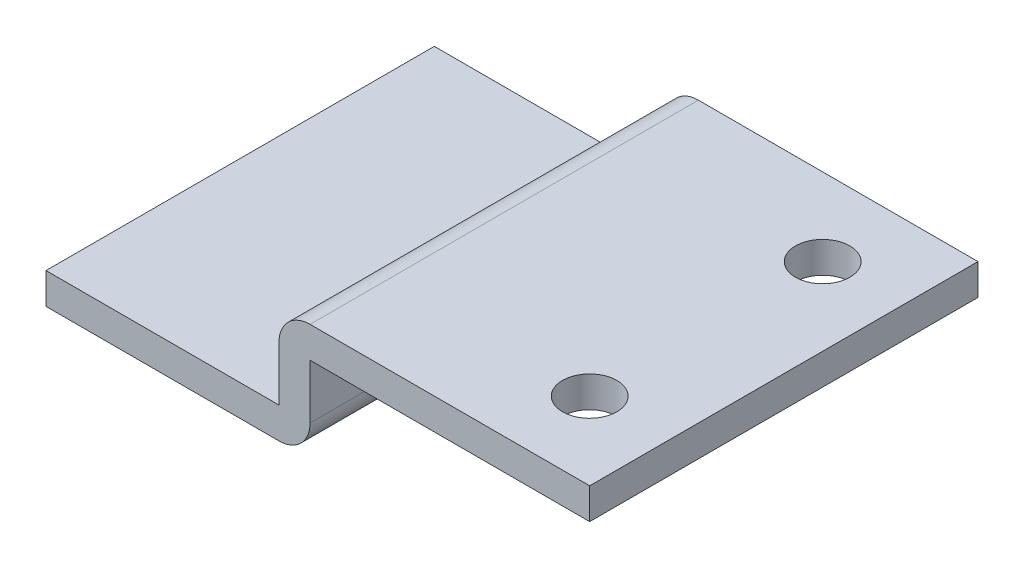
ISO-10303-21;
HEADER;
FILE_DESCRIPTION(('STEP AP214'),'2;1');
FILE_NAME('part.step','',(''),(''),'','','');
FILE_SCHEMA(('AUTOMOTIVE_DESIGN { 1 0 10303 214 1 1 1 1 }'));
ENDSEC;
DATA;
#1=APPLICATION_CONTEXT('core data for automotive mechanical design processes');
#2=APPLICATION_PROTOCOL_DEFINITION('international standard','automotive_design',2000,#1);
#3=PRODUCT_CONTEXT('',#1,'mechanical');
#4=PRODUCT('Part','Part','',(#3));
#5=PRODUCT_RELATED_PRODUCT_CATEGORY('part','',(#4));
#6=PRODUCT_DEFINITION_FORMATION('','',#4);
#7=PRODUCT_DEFINITION_CONTEXT('part definition',#1,'design');
#8=PRODUCT_DEFINITION('design','',#6,#7);
#9=PRODUCT_DEFINITION_SHAPE('','',#8);
#10=(LENGTH_UNIT() NAMED_UNIT(*) SI_UNIT(.MILLI.,.METRE.));
#11=(NAMED_UNIT(*) PLANE_ANGLE_UNIT() SI_UNIT($,.RADIAN.));
#12=(NAMED_UNIT(*) SI_UNIT($,.STERADIAN.) SOLID_ANGLE_UNIT());
#13=UNCERTAINTY_MEASURE_WITH_UNIT(LENGTH_MEASURE(1.E-05),#10,'distance_accuracy_value','');
#14=(GEOMETRIC_REPRESENTATION_CONTEXT(3) GLOBAL_UNCERTAINTY_ASSIGNED_CONTEXT((#13)) GLOBAL_UNIT_ASSIGNED_CONTEXT((#10,
#11,#12)) REPRESENTATION_CONTEXT('',''));
#15=CARTESIAN_POINT('',(0.,0.,0.));
#16=DIRECTION('',(0.,0.,1.));
#17=DIRECTION('',(1.,0.,0.));
#18=AXIS2_PLACEMENT_3D('',#15,#16,#17);
#19=CARTESIAN_POINT('',(0.,0.,12.5));
#20=DIRECTION('',(-1.,0.,0.));
#21=DIRECTION('',(0.,-1.,0.));
#22=AXIS2_PLACEMENT_3D('',#19,#20,#21);
#23=PLANE('',#22);
#24=DIRECTION('',(0.,1.,0.));
#25=VECTOR('',#24,1.);
#26=CARTESIAN_POINT('',(0.,0.,-12.5));
#27=LINE('',#26,#25);
#28=CARTESIAN_POINT('',(0.,0.,-12.5));
#29=VERTEX_POINT('',#28);
#30=CARTESIAN_POINT('',(0.,2.,-12.5));
#31=VERTEX_POINT('',#30);
#32=EDGE_CURVE('E128',#29,#31,#27,.T.);
#33=ORIENTED_EDGE('',*,*,#32,.T.);
#34=DIRECTION('',(0.,0.,-1.));
#35=VECTOR('',#34,1.);
#36=CARTESIAN_POINT('',(0.,2.,12.5));
#37=LINE('',#36,#35);
#38=CARTESIAN_POINT('',(0.,2.,12.5));
#39=VERTEX_POINT('',#38);
#40=EDGE_CURVE('E112',#39,#31,#37,.T.);
#41=ORIENTED_EDGE('',*,*,#40,.F.);
#42=DIRECTION('',(0.,1.,0.));
#43=VECTOR('',#42,1.);
#44=CARTESIAN_POINT('',(0.,0.,12.5));
#45=LINE('',#44,#43);
#46=CARTESIAN_POINT('',(0.,0.,12.5));
#47=VERTEX_POINT('',#46);
#48=EDGE_CURVE('E115',#47,#39,#45,.T.);
#49=ORIENTED_EDGE('',*,*,#48,.F.);
#50=DIRECTION('',(0.,0.,-1.));
#51=VECTOR('',#50,1.);
#52=CARTESIAN_POINT('',(0.,0.,12.5));
#53=LINE('',#52,#51);
#54=EDGE_CURVE('E173',#47,#29,#53,.T.);
#55=ORIENTED_EDGE('',*,*,#54,.T.);
#56=EDGE_LOOP('',(#33,#41,#49,#55));
#57=FACE_BOUND('',#56,.T.);
#58=ADVANCED_FACE('F32',(#57),#23,.F.);
#59=CARTESIAN_POINT('',(0.,2.,12.5));
#60=DIRECTION('',(0.,-1.,0.));
#61=DIRECTION('',(1.,0.,0.));
#62=AXIS2_PLACEMENT_3D('',#59,#60,#61);
#63=PLANE('',#62);
#64=CARTESIAN_POINT('',(-5.,2.,-7.5));
#65=DIRECTION('',(0.,1.,0.));
#66=DIRECTION('',(0.,0.,1.));
#67=AXIS2_PLACEMENT_3D('',#64,#65,#66);
#68=CIRCLE('',#67,1.74999999999999);
#69=CARTESIAN_POINT('',(-5.,2.,-5.75000000000001));
#70=VERTEX_POINT('',#69);
#71=EDGE_CURVE('E161',#70,#70,#68,.T.);
#72=ORIENTED_EDGE('',*,*,#71,.F.);
#73=EDGE_LOOP('',(#72));
#74=FACE_BOUND('',#73,.T.);
#75=CARTESIAN_POINT('',(-5.,2.,7.5));
#76=DIRECTION('',(0.,1.,0.));
#77=DIRECTION('',(0.,0.,1.));
#78=AXIS2_PLACEMENT_3D('',#75,#76,#77);
#79=CIRCLE('',#78,1.74999999999999);
#80=CARTESIAN_POINT('',(-5.,2.,9.24999999999999));
#81=VERTEX_POINT('',#80);
#82=EDGE_CURVE('E151',#81,#81,#79,.T.);
#83=ORIENTED_EDGE('',*,*,#82,.F.);
#84=EDGE_LOOP('',(#83));
#85=FACE_BOUND('',#84,.T.);
#86=DIRECTION('',(-1.,0.,0.));
#87=VECTOR('',#86,1.);
#88=CARTESIAN_POINT('',(0.,2.,-12.5));
#89=LINE('',#88,#87);
#90=CARTESIAN_POINT('',(-18.,2.,-12.5));
#91=VERTEX_POINT('',#90);
#92=EDGE_CURVE('E154',#31,#91,#89,.T.);
#93=ORIENTED_EDGE('',*,*,#92,.T.);
#94=DIRECTION('',(0.,0.,-1.));
#95=VECTOR('',#94,1.);
#96=CARTESIAN_POINT('',(-18.,2.,12.5));
#97=LINE('',#96,#95);
#98=CARTESIAN_POINT('',(-18.,2.,12.5));
#99=VERTEX_POINT('',#98);
#100=EDGE_CURVE('E11',#91,#99,#97,.F.);
#101=ORIENTED_EDGE('',*,*,#100,.T.);
#102=DIRECTION('',(-1.,0.,0.));
#103=VECTOR('',#102,1.);
#104=CARTESIAN_POINT('',(0.,2.,12.5));
#105=LINE('',#104,#103);
#106=EDGE_CURVE('E108',#39,#99,#105,.T.);
#107=ORIENTED_EDGE('',*,*,#106,.F.);
#108=ORIENTED_EDGE('',*,*,#40,.T.);
#109=EDGE_LOOP('',(#93,#101,#107,#108));
#110=FACE_BOUND('',#109,.T.);
#111=ADVANCED_FACE('F110',(#74,#85,#110),#63,.F.);
#112=CARTESIAN_POINT('',(-20.,2.,12.5));
#113=DIRECTION('',(1.,0.,0.));
#114=DIRECTION('',(0.,0.,-1.));
#115=AXIS2_PLACEMENT_3D('',#112,#113,#114);
#116=PLANE('',#115);
#117=DIRECTION('',(0.,-1.,0.));
#118=VECTOR('',#117,1.);
#119=CARTESIAN_POINT('',(-20.,2.,12.5));
#120=LINE('',#119,#118);
#121=CARTESIAN_POINT('',(-20.,0.,12.5));
#122=VERTEX_POINT('',#121);
#123=CARTESIAN_POINT('',(-20.,-3.5,12.5));
#124=VERTEX_POINT('',#123);
#125=EDGE_CURVE('E114',#122,#124,#120,.T.);
#126=ORIENTED_EDGE('',*,*,#125,.F.);
#127=DIRECTION('',(0.,0.,-1.));
#128=VECTOR('',#127,1.);
#129=CARTESIAN_POINT('',(-20.,0.,12.5));
#130=LINE('',#129,#128);
#131=CARTESIAN_POINT('',(-20.,0.,-12.5));
#132=VERTEX_POINT('',#131);
#133=EDGE_CURVE('E41',#122,#132,#130,.T.);
#134=ORIENTED_EDGE('',*,*,#133,.T.);
#135=DIRECTION('',(0.,-1.,0.));
#136=VECTOR('',#135,1.);
#137=CARTESIAN_POINT('',(-20.,2.,-12.5));
#138=LINE('',#137,#136);
#139=CARTESIAN_POINT('',(-20.,-3.5,-12.5));
#140=VERTEX_POINT('',#139);
#141=EDGE_CURVE('E176',#132,#140,#138,.T.);
#142=ORIENTED_EDGE('',*,*,#141,.T.);
#143=DIRECTION('',(0.,0.,-1.));
#144=VECTOR('',#143,1.);
#145=CARTESIAN_POINT('',(-20.,-3.5,12.5));
#146=LINE('',#145,#144);
#147=EDGE_CURVE('E130',#124,#140,#146,.T.);
#148=ORIENTED_EDGE('',*,*,#147,.F.);
#149=EDGE_LOOP('',(#126,#134,#142,#148));
#150=FACE_BOUND('',#149,.T.);
#151=ADVANCED_FACE('F227',(#150),#116,.F.);
#152=CARTESIAN_POINT('',(-20.,-3.5,12.5));
#153=DIRECTION('',(0.,-1.,0.));
#154=DIRECTION('',(1.,0.,0.));
#155=AXIS2_PLACEMENT_3D('',#152,#153,#154);
#156=PLANE('',#155);
#157=DIRECTION('',(-1.,0.,0.));
#158=VECTOR('',#157,1.);
#159=CARTESIAN_POINT('',(-20.,-3.5,-12.5));
#160=LINE('',#159,#158);
#161=CARTESIAN_POINT('',(-35.,-3.5,-12.5));
#162=VERTEX_POINT('',#161);
#163=EDGE_CURVE('E178',#140,#162,#160,.T.);
#164=ORIENTED_EDGE('',*,*,#163,.T.);
#165=DIRECTION('',(0.,0.,-1.));
#166=VECTOR('',#165,1.);
#167=CARTESIAN_POINT('',(-35.,-3.5,12.5));
#168=LINE('',#167,#166);
#169=CARTESIAN_POINT('',(-35.,-3.5,12.5));
#170=VERTEX_POINT('',#169);
#171=EDGE_CURVE('E136',#170,#162,#168,.T.);
#172=ORIENTED_EDGE('',*,*,#171,.F.);
#173=DIRECTION('',(-1.,0.,0.));
#174=VECTOR('',#173,1.);
#175=CARTESIAN_POINT('',(-20.,-3.5,12.5));
#176=LINE('',#175,#174);
#177=EDGE_CURVE('E165',#124,#170,#176,.T.);
#178=ORIENTED_EDGE('',*,*,#177,.F.);
#179=ORIENTED_EDGE('',*,*,#147,.T.);
#180=EDGE_LOOP('',(#164,#172,#178,#179));
#181=FACE_BOUND('',#180,.T.);
#182=ADVANCED_FACE('F229',(#181),#156,.F.);
#183=CARTESIAN_POINT('',(-35.,-5.5,12.5));
#184=DIRECTION('',(1.,0.,0.));
#185=DIRECTION('',(0.,0.,-1.));
#186=AXIS2_PLACEMENT_3D('',#183,#184,#185);
#187=PLANE('',#186);
#188=DIRECTION('',(0.,-1.,0.));
#189=VECTOR('',#188,1.);
#190=CARTESIAN_POINT('',(-35.,-5.5,-12.5));
#191=LINE('',#190,#189);
#192=CARTESIAN_POINT('',(-35.,-5.5,-12.5));
#193=VERTEX_POINT('',#192);
#194=EDGE_CURVE('E180',#162,#193,#191,.T.);
#195=ORIENTED_EDGE('',*,*,#194,.T.);
#196=DIRECTION('',(0.,0.,-1.));
#197=VECTOR('',#196,1.);
#198=CARTESIAN_POINT('',(-35.,-5.5,12.5));
#199=LINE('',#198,#197);
#200=CARTESIAN_POINT('',(-35.,-5.5,12.5));
#201=VERTEX_POINT('',#200);
#202=EDGE_CURVE('E192',#201,#193,#199,.T.);
#203=ORIENTED_EDGE('',*,*,#202,.F.);
#204=DIRECTION('',(0.,-1.,0.));
#205=VECTOR('',#204,1.);
#206=CARTESIAN_POINT('',(-35.,-5.5,12.5));
#207=LINE('',#206,#205);
#208=EDGE_CURVE('E167',#170,#201,#207,.T.);
#209=ORIENTED_EDGE('',*,*,#208,.F.);
#210=ORIENTED_EDGE('',*,*,#171,.T.);
#211=EDGE_LOOP('',(#195,#203,#209,#210));
#212=FACE_BOUND('',#211,.T.);
#213=ADVANCED_FACE('F199',(#212),#187,.F.);
#214=CARTESIAN_POINT('',(-18.,-5.5,12.5));
#215=DIRECTION('',(0.,1.,0.));
#216=DIRECTION('',(-1.,0.,0.));
#217=AXIS2_PLACEMENT_3D('',#214,#215,#216);
#218=PLANE('',#217);
#219=DIRECTION('',(1.,0.,0.));
#220=VECTOR('',#219,1.);
#221=CARTESIAN_POINT('',(-18.,-5.5,-12.5));
#222=LINE('',#221,#220);
#223=CARTESIAN_POINT('',(-20.,-5.5,-12.5));
#224=VERTEX_POINT('',#223);
#225=EDGE_CURVE('E182',#193,#224,#222,.T.);
#226=ORIENTED_EDGE('',*,*,#225,.T.);
#227=DIRECTION('',(0.,0.,-1.));
#228=VECTOR('',#227,1.);
#229=CARTESIAN_POINT('',(-20.,-5.5,12.5));
#230=LINE('',#229,#228);
#231=CARTESIAN_POINT('',(-20.,-5.5,12.5));
#232=VERTEX_POINT('',#231);
#233=EDGE_CURVE('E143',#224,#232,#230,.F.);
#234=ORIENTED_EDGE('',*,*,#233,.T.);
#235=DIRECTION('',(1.,0.,0.));
#236=VECTOR('',#235,1.);
#237=CARTESIAN_POINT('',(-18.,-5.5,12.5));
#238=LINE('',#237,#236);
#239=EDGE_CURVE('E169',#201,#232,#238,.T.);
#240=ORIENTED_EDGE('',*,*,#239,.F.);
#241=ORIENTED_EDGE('',*,*,#202,.T.);
#242=EDGE_LOOP('',(#226,#234,#240,#241));
#243=FACE_BOUND('',#242,.T.);
#244=ADVANCED_FACE('F211',(#243),#218,.F.);
#245=CARTESIAN_POINT('',(-18.,0.,12.5));
#246=DIRECTION('',(-1.,0.,0.));
#247=DIRECTION('',(0.,-1.,0.));
#248=AXIS2_PLACEMENT_3D('',#245,#246,#247);
#249=PLANE('',#248);
#250=DIRECTION('',(0.,1.,0.));
#251=VECTOR('',#250,1.);
#252=CARTESIAN_POINT('',(-18.,0.,12.5));
#253=LINE('',#252,#251);
#254=CARTESIAN_POINT('',(-18.,-3.5,12.5));
#255=VERTEX_POINT('',#254);
#256=CARTESIAN_POINT('',(-18.,0.,12.5));
#257=VERTEX_POINT('',#256);
#258=EDGE_CURVE('E171',#255,#257,#253,.T.);
#259=ORIENTED_EDGE('',*,*,#258,.F.);
#260=DIRECTION('',(0.,0.,-1.));
#261=VECTOR('',#260,1.);
#262=CARTESIAN_POINT('',(-18.,-3.5,12.5));
#263=LINE('',#262,#261);
#264=CARTESIAN_POINT('',(-18.,-3.5,-12.5));
#265=VERTEX_POINT('',#264);
#266=EDGE_CURVE('E129',#255,#265,#263,.T.);
#267=ORIENTED_EDGE('',*,*,#266,.T.);
#268=DIRECTION('',(0.,1.,0.));
#269=VECTOR('',#268,1.);
#270=CARTESIAN_POINT('',(-18.,0.,-12.5));
#271=LINE('',#270,#269);
#272=CARTESIAN_POINT('',(-18.,0.,-12.5));
#273=VERTEX_POINT('',#272);
#274=EDGE_CURVE('E185',#265,#273,#271,.T.);
#275=ORIENTED_EDGE('',*,*,#274,.T.);
#276=DIRECTION('',(0.,0.,-1.));
#277=VECTOR('',#276,1.);
#278=CARTESIAN_POINT('',(-18.,0.,12.5));
#279=LINE('',#278,#277);
#280=EDGE_CURVE('E189',#257,#273,#279,.T.);
#281=ORIENTED_EDGE('',*,*,#280,.F.);
#282=EDGE_LOOP('',(#259,#267,#275,#281));
#283=FACE_BOUND('',#282,.T.);
#284=ADVANCED_FACE('F220',(#283),#249,.F.);
#285=CARTESIAN_POINT('',(0.,0.,12.5));
#286=DIRECTION('',(0.,1.,0.));
#287=DIRECTION('',(-1.,0.,0.));
#288=AXIS2_PLACEMENT_3D('',#285,#286,#287);
#289=PLANE('',#288);
#290=CARTESIAN_POINT('',(-5.,0.,-7.5));
#291=DIRECTION('',(0.,1.,0.));
#292=DIRECTION('',(-1.,0.,0.));
#293=AXIS2_PLACEMENT_3D('',#290,#291,#292);
#294=CIRCLE('',#293,1.74999999999999);
#295=CARTESIAN_POINT('',(-6.74999999999999,0.,-7.5));
#296=VERTEX_POINT('',#295);
#297=EDGE_CURVE('E36',#296,#296,#294,.T.);
#298=ORIENTED_EDGE('',*,*,#297,.T.);
#299=EDGE_LOOP('',(#298));
#300=FACE_BOUND('',#299,.T.);
#301=CARTESIAN_POINT('',(-5.,0.,7.5));
#302=DIRECTION('',(0.,1.,0.));
#303=DIRECTION('',(-1.,0.,0.));
#304=AXIS2_PLACEMENT_3D('',#301,#302,#303);
#305=CIRCLE('',#304,1.74999999999999);
#306=CARTESIAN_POINT('',(-6.74999999999999,0.,7.5));
#307=VERTEX_POINT('',#306);
#308=EDGE_CURVE('E149',#307,#307,#305,.T.);
#309=ORIENTED_EDGE('',*,*,#308,.T.);
#310=EDGE_LOOP('',(#309));
#311=FACE_BOUND('',#310,.T.);
#312=DIRECTION('',(1.,0.,0.));
#313=VECTOR('',#312,1.);
#314=CARTESIAN_POINT('',(0.,0.,-12.5));
#315=LINE('',#314,#313);
#316=EDGE_CURVE('E125',#273,#29,#315,.T.);
#317=ORIENTED_EDGE('',*,*,#316,.T.);
#318=ORIENTED_EDGE('',*,*,#54,.F.);
#319=DIRECTION('',(1.,0.,0.));
#320=VECTOR('',#319,1.);
#321=CARTESIAN_POINT('',(0.,0.,12.5));
#322=LINE('',#321,#320);
#323=EDGE_CURVE('E121',#257,#47,#322,.T.);
#324=ORIENTED_EDGE('',*,*,#323,.F.);
#325=ORIENTED_EDGE('',*,*,#280,.T.);
#326=EDGE_LOOP('',(#317,#318,#324,#325));
#327=FACE_BOUND('',#326,.T.);
#328=ADVANCED_FACE('F223',(#300,#311,#327),#289,.F.);
#329=CARTESIAN_POINT('',(0.,2.,12.5));
#330=DIRECTION('',(0.,0.,1.));
#331=DIRECTION('',(1.,0.,0.));
#332=AXIS2_PLACEMENT_3D('',#329,#330,#331);
#333=PLANE('',#332);
#334=ORIENTED_EDGE('',*,*,#239,.T.);
#335=CARTESIAN_POINT('',(-20.,-3.5,12.5));
#336=DIRECTION('',(0.,0.,1.));
#337=DIRECTION('',(1.,0.,0.));
#338=AXIS2_PLACEMENT_3D('',#335,#336,#337);
#339=CIRCLE('',#338,2.);
#340=EDGE_CURVE('E146',#232,#255,#339,.T.);
#341=ORIENTED_EDGE('',*,*,#340,.T.);
#342=ORIENTED_EDGE('',*,*,#258,.T.);
#343=ORIENTED_EDGE('',*,*,#323,.T.);
#344=ORIENTED_EDGE('',*,*,#48,.T.);
#345=ORIENTED_EDGE('',*,*,#106,.T.);
#346=CARTESIAN_POINT('',(-18.,0.,12.5));
#347=DIRECTION('',(0.,0.,1.));
#348=DIRECTION('',(1.,0.,0.));
#349=AXIS2_PLACEMENT_3D('',#346,#347,#348);
#350=CIRCLE('',#349,2.);
#351=EDGE_CURVE('E49',#99,#122,#350,.T.);
#352=ORIENTED_EDGE('',*,*,#351,.T.);
#353=ORIENTED_EDGE('',*,*,#125,.T.);
#354=ORIENTED_EDGE('',*,*,#177,.T.);
#355=ORIENTED_EDGE('',*,*,#208,.T.);
#356=EDGE_LOOP('',(#334,#341,#342,#343,#344,#345,#352,#353,#354,#355));
#357=FACE_BOUND('',#356,.T.);
#358=ADVANCED_FACE('F119',(#357),#333,.T.);
#359=CARTESIAN_POINT('',(0.,2.,-12.5));
#360=DIRECTION('',(0.,0.,1.));
#361=DIRECTION('',(1.,0.,0.));
#362=AXIS2_PLACEMENT_3D('',#359,#360,#361);
#363=PLANE('',#362);
#364=ORIENTED_EDGE('',*,*,#274,.F.);
#365=CARTESIAN_POINT('',(-20.,-3.5,-12.5));
#366=DIRECTION('',(0.,0.,1.));
#367=DIRECTION('',(1.,0.,0.));
#368=AXIS2_PLACEMENT_3D('',#365,#366,#367);
#369=CIRCLE('',#368,2.);
#370=EDGE_CURVE('E141',#265,#224,#369,.F.);
#371=ORIENTED_EDGE('',*,*,#370,.T.);
#372=ORIENTED_EDGE('',*,*,#225,.F.);
#373=ORIENTED_EDGE('',*,*,#194,.F.);
#374=ORIENTED_EDGE('',*,*,#163,.F.);
#375=ORIENTED_EDGE('',*,*,#141,.F.);
#376=CARTESIAN_POINT('',(-18.,0.,-12.5));
#377=DIRECTION('',(0.,0.,1.));
#378=DIRECTION('',(1.,0.,0.));
#379=AXIS2_PLACEMENT_3D('',#376,#377,#378);
#380=CIRCLE('',#379,2.);
#381=EDGE_CURVE('E133',#132,#91,#380,.F.);
#382=ORIENTED_EDGE('',*,*,#381,.T.);
#383=ORIENTED_EDGE('',*,*,#92,.F.);
#384=ORIENTED_EDGE('',*,*,#32,.F.);
#385=ORIENTED_EDGE('',*,*,#316,.F.);
#386=EDGE_LOOP('',(#364,#371,#372,#373,#374,#375,#382,#383,#384,#385));
#387=FACE_BOUND('',#386,.T.);
#388=ADVANCED_FACE('F207',(#387),#363,.F.);
#389=CARTESIAN_POINT('',(-20.,-3.5,12.5));
#390=DIRECTION('',(0.,0.,-1.));
#391=DIRECTION('',(-1.,0.,0.));
#392=AXIS2_PLACEMENT_3D('',#389,#390,#391);
#393=CYLINDRICAL_SURFACE('',#392,2.);
#394=ORIENTED_EDGE('',*,*,#340,.F.);
#395=ORIENTED_EDGE('',*,*,#233,.F.);
#396=ORIENTED_EDGE('',*,*,#370,.F.);
#397=ORIENTED_EDGE('',*,*,#266,.F.);
#398=EDGE_LOOP('',(#394,#395,#396,#397));
#399=FACE_BOUND('',#398,.T.);
#400=ADVANCED_FACE('F215',(#399),#393,.T.);
#401=CARTESIAN_POINT('',(-18.,0.,12.5));
#402=DIRECTION('',(0.,0.,-1.));
#403=DIRECTION('',(-1.,0.,0.));
#404=AXIS2_PLACEMENT_3D('',#401,#402,#403);
#405=CYLINDRICAL_SURFACE('',#404,2.);
#406=ORIENTED_EDGE('',*,*,#351,.F.);
#407=ORIENTED_EDGE('',*,*,#100,.F.);
#408=ORIENTED_EDGE('',*,*,#381,.F.);
#409=ORIENTED_EDGE('',*,*,#133,.F.);
#410=EDGE_LOOP('',(#406,#407,#408,#409));
#411=FACE_BOUND('',#410,.T.);
#412=ADVANCED_FACE('F34',(#411),#405,.T.);
#413=CARTESIAN_POINT('',(-5.,2.,7.5));
#414=DIRECTION('',(0.,1.,0.));
#415=DIRECTION('',(0.,0.,1.));
#416=AXIS2_PLACEMENT_3D('',#413,#414,#415);
#417=CYLINDRICAL_SURFACE('',#416,1.74999999999999);
#418=ORIENTED_EDGE('',*,*,#82,.T.);
#419=EDGE_LOOP('',(#418));
#420=FACE_BOUND('',#419,.T.);
#421=ORIENTED_EDGE('',*,*,#308,.F.);
#422=EDGE_LOOP('',(#421));
#423=FACE_BOUND('',#422,.T.);
#424=ADVANCED_FACE('F250',(#420,#423),#417,.F.);
#425=CARTESIAN_POINT('',(-5.,2.,-7.5));
#426=DIRECTION('',(0.,1.,0.));
#427=DIRECTION('',(0.,0.,1.));
#428=AXIS2_PLACEMENT_3D('',#425,#426,#427);
#429=CYLINDRICAL_SURFACE('',#428,1.74999999999999);
#430=ORIENTED_EDGE('',*,*,#71,.T.);
#431=EDGE_LOOP('',(#430));
#432=FACE_BOUND('',#431,.T.);
#433=ORIENTED_EDGE('',*,*,#297,.F.);
#434=EDGE_LOOP('',(#433));
#435=FACE_BOUND('',#434,.T.);
#436=ADVANCED_FACE('F333',(#432,#435),#429,.F.);
#437=CLOSED_SHELL('',(#58,#111,#151,#182,#213,#244,#284,#328,#358,#388,#400,#412,#424,#436));
#438=MANIFOLD_SOLID_BREP('B2',#437);
#439=ADVANCED_BREP_SHAPE_REPRESENTATION('',(#18,#438),#14);
#440=SHAPE_DEFINITION_REPRESENTATION(#9,#439);
ENDSEC;
END-ISO-10303-21;
